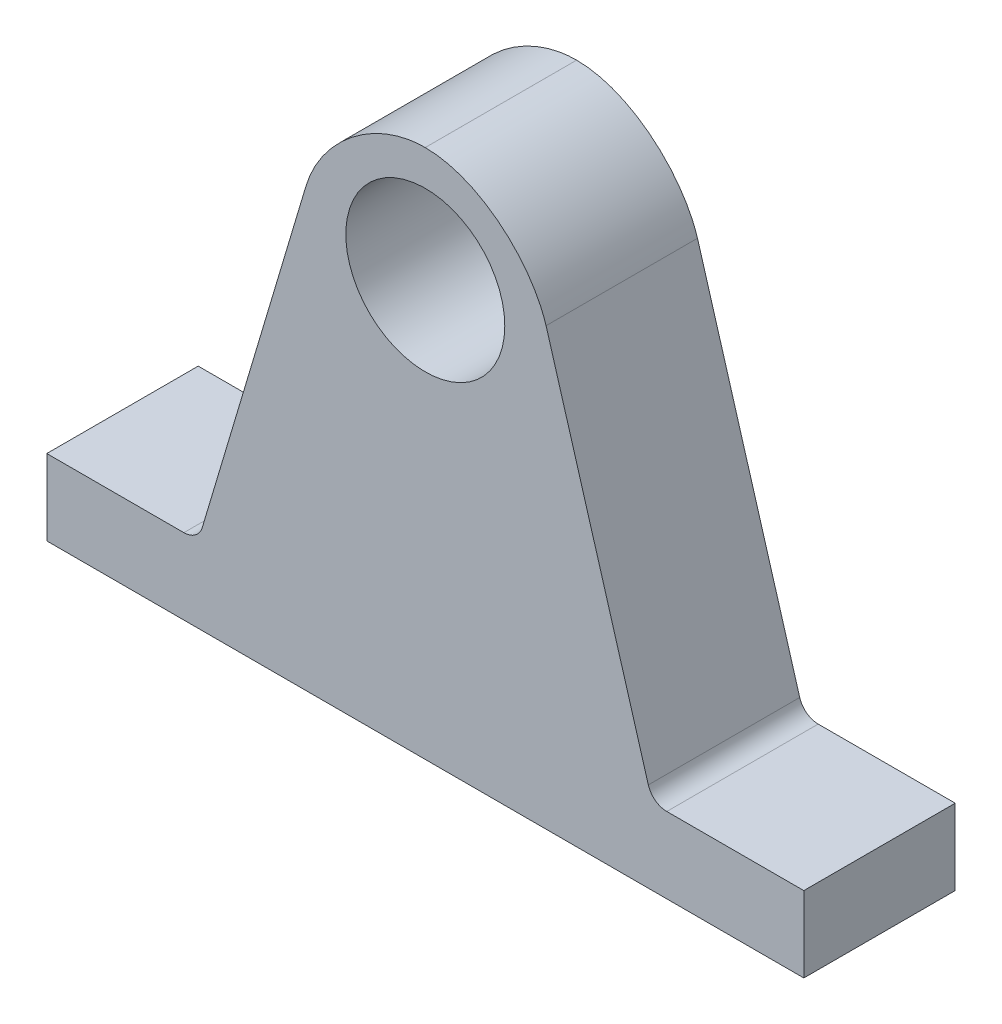
ISO-10303-21;
HEADER;
FILE_DESCRIPTION(('STEP AP214'),'2;1');
FILE_NAME('part.step','',(''),(''),'','','');
FILE_SCHEMA(('AUTOMOTIVE_DESIGN { 1 0 10303 214 1 1 1 1 }'));
ENDSEC;
DATA;
#1=APPLICATION_CONTEXT('core data for automotive mechanical design processes');
#2=APPLICATION_PROTOCOL_DEFINITION('international standard','automotive_design',2000,#1);
#3=PRODUCT_CONTEXT('',#1,'mechanical');
#4=PRODUCT('Part','Part','',(#3));
#5=PRODUCT_RELATED_PRODUCT_CATEGORY('part','',(#4));
#6=PRODUCT_DEFINITION_FORMATION('','',#4);
#7=PRODUCT_DEFINITION_CONTEXT('part definition',#1,'design');
#8=PRODUCT_DEFINITION('design','',#6,#7);
#9=PRODUCT_DEFINITION_SHAPE('','',#8);
#10=(LENGTH_UNIT() NAMED_UNIT(*) SI_UNIT(.MILLI.,.METRE.));
#11=(NAMED_UNIT(*) PLANE_ANGLE_UNIT() SI_UNIT($,.RADIAN.));
#12=(NAMED_UNIT(*) SI_UNIT($,.STERADIAN.) SOLID_ANGLE_UNIT());
#13=UNCERTAINTY_MEASURE_WITH_UNIT(LENGTH_MEASURE(1.E-05),#10,'distance_accuracy_value','');
#14=(GEOMETRIC_REPRESENTATION_CONTEXT(3) GLOBAL_UNCERTAINTY_ASSIGNED_CONTEXT((#13)) GLOBAL_UNIT_ASSIGNED_CONTEXT((#10,
#11,#12)) REPRESENTATION_CONTEXT('',''));
#15=CARTESIAN_POINT('',(0.,0.,0.));
#16=DIRECTION('',(0.,0.,1.));
#17=DIRECTION('',(1.,0.,0.));
#18=AXIS2_PLACEMENT_3D('',#15,#16,#17);
#19=CARTESIAN_POINT('',(32.7115208670572,12.54,-44.5746974611739));
#20=DIRECTION('',(0.,0.,1.));
#21=DIRECTION('',(1.,0.,0.));
#22=AXIS2_PLACEMENT_3D('',#19,#20,#21);
#23=CYLINDRICAL_SURFACE('',#22,2.54);
#24=DIRECTION('',(0.,0.,-1.));
#25=VECTOR('',#24,1.);
#26=CARTESIAN_POINT('',(30.2753489746446,11.8212048201201,-44.5746974611739));
#27=LINE('',#26,#25);
#28=CARTESIAN_POINT('',(30.2753489746446,11.8212048201201,15.4253025388261));
#29=VERTEX_POINT('',#28);
#30=CARTESIAN_POINT('',(30.2753489746446,11.8212048201201,-4.57469746117392));
#31=VERTEX_POINT('',#30);
#32=EDGE_CURVE('E284',#29,#31,#27,.T.);
#33=ORIENTED_EDGE('',*,*,#32,.F.);
#34=CARTESIAN_POINT('',(32.7115208670572,12.54,15.4253025388261));
#35=DIRECTION('',(0.,0.,-1.));
#36=DIRECTION('',(-1.,0.,0.));
#37=AXIS2_PLACEMENT_3D('',#34,#35,#36);
#38=CIRCLE('',#37,2.54);
#39=CARTESIAN_POINT('',(32.7115208670573,10.,15.4253025388261));
#40=VERTEX_POINT('',#39);
#41=EDGE_CURVE('E74',#29,#40,#38,.F.);
#42=ORIENTED_EDGE('',*,*,#41,.T.);
#43=DIRECTION('',(0.,0.,-1.));
#44=VECTOR('',#43,1.);
#45=CARTESIAN_POINT('',(32.7115208670572,10.,-44.5746974611739));
#46=LINE('',#45,#44);
#47=CARTESIAN_POINT('',(32.7115208670573,10.,-4.57469746117392));
#48=VERTEX_POINT('',#47);
#49=EDGE_CURVE('E286',#48,#40,#46,.F.);
#50=ORIENTED_EDGE('',*,*,#49,.F.);
#51=CARTESIAN_POINT('',(32.7115208670572,12.54,-4.57469746117392));
#52=DIRECTION('',(0.,0.,1.));
#53=DIRECTION('',(1.,0.,0.));
#54=AXIS2_PLACEMENT_3D('',#51,#52,#53);
#55=CIRCLE('',#54,2.54);
#56=EDGE_CURVE('E12',#48,#31,#55,.F.);
#57=ORIENTED_EDGE('',*,*,#56,.T.);
#58=EDGE_LOOP('',(#33,#42,#50,#57));
#59=FACE_BOUND('',#58,.T.);
#60=ADVANCED_FACE('F67',(#59),#23,.F.);
#61=CARTESIAN_POINT('',(-31.0801536854342,12.54,-44.5746974611739));
#62=DIRECTION('',(0.,0.,1.));
#63=DIRECTION('',(1.,0.,0.));
#64=AXIS2_PLACEMENT_3D('',#61,#62,#63);
#65=CYLINDRICAL_SURFACE('',#64,2.54);
#66=DIRECTION('',(0.,0.,1.));
#67=VECTOR('',#66,1.);
#68=CARTESIAN_POINT('',(-28.6461637260663,11.813850650557,-44.5746974611739));
#69=LINE('',#68,#67);
#70=CARTESIAN_POINT('',(-28.6461637260663,11.813850650557,-4.57469746117392));
#71=VERTEX_POINT('',#70);
#72=CARTESIAN_POINT('',(-28.6461637260663,11.813850650557,15.4253025388261));
#73=VERTEX_POINT('',#72);
#74=EDGE_CURVE('E240',#71,#73,#69,.T.);
#75=ORIENTED_EDGE('',*,*,#74,.F.);
#76=CARTESIAN_POINT('',(-31.0801536854342,12.54,-4.57469746117392));
#77=DIRECTION('',(0.,0.,1.));
#78=DIRECTION('',(1.,0.,0.));
#79=AXIS2_PLACEMENT_3D('',#76,#77,#78);
#80=CIRCLE('',#79,2.54);
#81=CARTESIAN_POINT('',(-31.0801536854342,10.,-4.57469746117392));
#82=VERTEX_POINT('',#81);
#83=EDGE_CURVE('E348',#71,#82,#80,.F.);
#84=ORIENTED_EDGE('',*,*,#83,.T.);
#85=DIRECTION('',(0.,0.,1.));
#86=VECTOR('',#85,1.);
#87=CARTESIAN_POINT('',(-31.0801536854342,10.,0.));
#88=LINE('',#87,#86);
#89=CARTESIAN_POINT('',(-31.0801536854342,10.,15.4253025388261));
#90=VERTEX_POINT('',#89);
#91=EDGE_CURVE('E243',#90,#82,#88,.F.);
#92=ORIENTED_EDGE('',*,*,#91,.F.);
#93=CARTESIAN_POINT('',(-31.0801536854342,12.54,15.4253025388261));
#94=DIRECTION('',(0.,0.,-1.));
#95=DIRECTION('',(-1.,0.,0.));
#96=AXIS2_PLACEMENT_3D('',#93,#94,#95);
#97=CIRCLE('',#96,2.54);
#98=EDGE_CURVE('E287',#90,#73,#97,.F.);
#99=ORIENTED_EDGE('',*,*,#98,.T.);
#100=EDGE_LOOP('',(#75,#84,#92,#99));
#101=FACE_BOUND('',#100,.T.);
#102=ADVANCED_FACE('F347',(#101),#65,.F.);
#103=CARTESIAN_POINT('',(-49.187302552387,10.,15.4253025388261));
#104=DIRECTION('',(0.,0.,-1.));
#105=DIRECTION('',(-1.,0.,0.));
#106=AXIS2_PLACEMENT_3D('',#103,#104,#105);
#107=PLANE('',#106);
#108=ORIENTED_EDGE('',*,*,#41,.F.);
#109=DIRECTION('',(-0.28299022829917,0.959122792288445,0.));
#110=VECTOR('',#109,1.);
#111=CARTESIAN_POINT('',(31.0593335166884,9.16409030561789,15.4253025388261));
#112=LINE('',#111,#110);
#113=CARTESIAN_POINT('',(16.7674884994213,57.6026331567285,15.4253025388261));
#114=VERTEX_POINT('',#113);
#115=EDGE_CURVE('E153',#29,#114,#112,.T.);
#116=ORIENTED_EDGE('',*,*,#115,.T.);
#117=CARTESIAN_POINT('',(-14.9856740840796,57.6026331567285,15.4253025388261));
#118=CARTESIAN_POINT('',(-13.1285771504225,64.0995192015089,15.4253025388261));
#119=CARTESIAN_POINT('',(0.864488627951838,75.934906687618,15.4253025388261));
#120=CARTESIAN_POINT('',(14.7692056651984,64.0304810450589,15.4253025388261));
#121=CARTESIAN_POINT('',(16.7674884994213,57.6026331567285,15.4253025388261));
#122=B_SPLINE_CURVE_WITH_KNOTS('',3,(#117,#118,#119,#120,#121),.UNSPECIFIED.,.F.,.F.,(4,1,4),
(0.,0.49893525965505,1.),.UNSPECIFIED.);
#123=CARTESIAN_POINT('',(0.805895989723645,70.,15.4253025388261));
#124=VERTEX_POINT('',#123);
#125=EDGE_CURVE('E159',#124,#114,#122,.T.);
#126=ORIENTED_EDGE('',*,*,#125,.F.);
#127=DIRECTION('',(1.,0.,0.));
#128=VECTOR('',#127,1.);
#129=CARTESIAN_POINT('',(0.,70.,15.4253025388261));
#130=LINE('',#129,#128);
#131=CARTESIAN_POINT('',(0.804550116485897,70.000002024231,15.4253025388261));
#132=VERTEX_POINT('',#131);
#133=EDGE_CURVE('E268',#132,#124,#130,.T.);
#134=ORIENTED_EDGE('',*,*,#133,.F.);
#135=CARTESIAN_POINT('',(-14.9856740840796,57.6026331567285,15.4253025388261));
#136=CARTESIAN_POINT('',(-13.1285771504225,64.0995192015089,15.4253025388261));
#137=CARTESIAN_POINT('',(0.864488627951838,75.934906687618,15.4253025388261));
#138=CARTESIAN_POINT('',(14.7692056651984,64.0304810450589,15.4253025388261));
#139=CARTESIAN_POINT('',(16.7674884994213,57.6026331567285,15.4253025388261));
#140=B_SPLINE_CURVE_WITH_KNOTS('',3,(#135,#136,#137,#138,#139),.UNSPECIFIED.,.F.,.F.,(4,1,4),
(0.,0.49893525965505,1.),.UNSPECIFIED.);
#141=CARTESIAN_POINT('',(-14.9856740840796,57.6026331567285,15.4253025388261));
#142=VERTEX_POINT('',#141);
#143=EDGE_CURVE('E209',#142,#132,#140,.T.);
#144=ORIENTED_EDGE('',*,*,#143,.F.);
#145=DIRECTION('',(0.285885570646856,0.958263763530648,0.));
#146=VECTOR('',#145,1.);
#147=CARTESIAN_POINT('',(-29.5413458130373,8.81327754095562,15.4253025388261));
#148=LINE('',#147,#146);
#149=EDGE_CURVE('E176',#73,#142,#148,.T.);
#150=ORIENTED_EDGE('',*,*,#149,.F.);
#151=ORIENTED_EDGE('',*,*,#98,.F.);
#152=DIRECTION('',(1.,0.,0.));
#153=VECTOR('',#152,1.);
#154=CARTESIAN_POINT('',(-49.187302552387,10.,15.4253025388261));
#155=LINE('',#154,#153);
#156=CARTESIAN_POINT('',(-49.187302552387,10.,15.4253025388261));
#157=VERTEX_POINT('',#156);
#158=EDGE_CURVE('E263',#157,#90,#155,.T.);
#159=ORIENTED_EDGE('',*,*,#158,.F.);
#160=DIRECTION('',(0.,-1.,0.));
#161=VECTOR('',#160,1.);
#162=CARTESIAN_POINT('',(-49.187302552387,10.,15.4253025388261));
#163=LINE('',#162,#161);
#164=CARTESIAN_POINT('',(-49.187302552387,0.,15.4253025388261));
#165=VERTEX_POINT('',#164);
#166=EDGE_CURVE('E271',#157,#165,#163,.T.);
#167=ORIENTED_EDGE('',*,*,#166,.T.);
#168=DIRECTION('',(1.,0.,0.));
#169=VECTOR('',#168,1.);
#170=CARTESIAN_POINT('',(-49.187302552387,0.,15.4253025388261));
#171=LINE('',#170,#169);
#172=CARTESIAN_POINT('',(50.812697447613,0.,15.4253025388261));
#173=VERTEX_POINT('',#172);
#174=EDGE_CURVE('E300',#165,#173,#171,.T.);
#175=ORIENTED_EDGE('',*,*,#174,.T.);
#176=DIRECTION('',(0.,-1.,0.));
#177=VECTOR('',#176,1.);
#178=CARTESIAN_POINT('',(50.812697447613,10.,15.4253025388261));
#179=LINE('',#178,#177);
#180=CARTESIAN_POINT('',(50.812697447613,10.,15.4253025388261));
#181=VERTEX_POINT('',#180);
#182=EDGE_CURVE('E316',#181,#173,#179,.T.);
#183=ORIENTED_EDGE('',*,*,#182,.F.);
#184=EDGE_CURVE('E288',#40,#181,#155,.T.);
#185=ORIENTED_EDGE('',*,*,#184,.F.);
#186=EDGE_LOOP('',(#108,#116,#126,#134,#144,#150,#151,#159,#167,#175,#183,#185));
#187=FACE_BOUND('',#186,.T.);
#188=CARTESIAN_POINT('',(0.812697447612962,54.837920596,15.4253025388261));
#189=DIRECTION('',(0.,0.,1.));
#190=DIRECTION('',(1.,0.,0.));
#191=AXIS2_PLACEMENT_3D('',#188,#189,#190);
#192=CIRCLE('',#191,10.5);
#193=CARTESIAN_POINT('',(11.312697447613,54.837920596,15.4253025388261));
#194=VERTEX_POINT('',#193);
#195=EDGE_CURVE('E233',#194,#194,#192,.T.);
#196=ORIENTED_EDGE('',*,*,#195,.F.);
#197=EDGE_LOOP('',(#196));
#198=FACE_BOUND('',#197,.T.);
#199=ADVANCED_FACE('F155',(#187,#198),#107,.F.);
#200=CARTESIAN_POINT('',(-49.187302552387,10.,-4.57469746117392));
#201=DIRECTION('',(0.,0.,1.));
#202=DIRECTION('',(1.,0.,0.));
#203=AXIS2_PLACEMENT_3D('',#200,#201,#202);
#204=PLANE('',#203);
#205=ORIENTED_EDGE('',*,*,#83,.F.);
#206=DIRECTION('',(0.285885570646856,0.958263763530648,0.));
#207=VECTOR('',#206,1.);
#208=CARTESIAN_POINT('',(-30.8219137424686,4.52092434265674,-4.57469746117392));
#209=LINE('',#208,#207);
#210=CARTESIAN_POINT('',(-14.9856740840796,57.6026331567285,-4.57469746117392));
#211=VERTEX_POINT('',#210);
#212=EDGE_CURVE('E227',#71,#211,#209,.T.);
#213=ORIENTED_EDGE('',*,*,#212,.T.);
#214=CARTESIAN_POINT('',(-14.9856740840796,57.6026331567285,-4.57469746117392));
#215=CARTESIAN_POINT('',(-13.1285771504225,64.0995192015089,-4.57469746117392));
#216=CARTESIAN_POINT('',(0.864488627951838,75.934906687618,-4.57469746117392));
#217=CARTESIAN_POINT('',(14.7692056651984,64.0304810450589,-4.57469746117392));
#218=CARTESIAN_POINT('',(16.7674884994213,57.6026331567285,-4.57469746117392));
#219=B_SPLINE_CURVE_WITH_KNOTS('',3,(#214,#215,#216,#217,#218),.UNSPECIFIED.,.F.,.F.,(4,1,4),
(0.,0.49893525965505,1.),.UNSPECIFIED.);
#220=CARTESIAN_POINT('',(0.804550116485899,70.0000026989747,-4.57469746117393));
#221=VERTEX_POINT('',#220);
#222=EDGE_CURVE('E222',#211,#221,#219,.T.);
#223=ORIENTED_EDGE('',*,*,#222,.T.);
#224=DIRECTION('',(-1.,0.,0.));
#225=VECTOR('',#224,1.);
#226=CARTESIAN_POINT('',(-29.187302552387,70.,-4.57469746117392));
#227=LINE('',#226,#225);
#228=CARTESIAN_POINT('',(0.805895989723645,70.,-4.57469746117392));
#229=VERTEX_POINT('',#228);
#230=EDGE_CURVE('E275',#229,#221,#227,.T.);
#231=ORIENTED_EDGE('',*,*,#230,.F.);
#232=CARTESIAN_POINT('',(-14.9856740840796,57.6026331567285,-4.57469746117392));
#233=CARTESIAN_POINT('',(-13.1285771504225,64.0995192015089,-4.57469746117392));
#234=CARTESIAN_POINT('',(0.864488627951838,75.934906687618,-4.57469746117392));
#235=CARTESIAN_POINT('',(14.7692056651984,64.0304810450589,-4.57469746117392));
#236=CARTESIAN_POINT('',(16.7674884994213,57.6026331567285,-4.57469746117392));
#237=B_SPLINE_CURVE_WITH_KNOTS('',3,(#232,#233,#234,#235,#236),.UNSPECIFIED.,.F.,.F.,(4,1,4),
(0.,0.49893525965505,1.),.UNSPECIFIED.);
#238=CARTESIAN_POINT('',(16.7674884994213,57.6026331567285,-4.57469746117392));
#239=VERTEX_POINT('',#238);
#240=EDGE_CURVE('E244',#229,#239,#237,.T.);
#241=ORIENTED_EDGE('',*,*,#240,.T.);
#242=DIRECTION('',(-0.28299022829917,0.959122792288445,0.));
#243=VECTOR('',#242,1.);
#244=CARTESIAN_POINT('',(24.4060199025876,31.7137902365315,-4.57469746117392));
#245=LINE('',#244,#243);
#246=EDGE_CURVE('E169',#31,#239,#245,.T.);
#247=ORIENTED_EDGE('',*,*,#246,.F.);
#248=ORIENTED_EDGE('',*,*,#56,.F.);
#249=DIRECTION('',(-1.,0.,0.));
#250=VECTOR('',#249,1.);
#251=CARTESIAN_POINT('',(-49.187302552387,10.,-4.57469746117392));
#252=LINE('',#251,#250);
#253=CARTESIAN_POINT('',(50.812697447613,10.,-4.57469746117392));
#254=VERTEX_POINT('',#253);
#255=EDGE_CURVE('E248',#254,#48,#252,.T.);
#256=ORIENTED_EDGE('',*,*,#255,.F.);
#257=DIRECTION('',(0.,-1.,0.));
#258=VECTOR('',#257,1.);
#259=CARTESIAN_POINT('',(50.812697447613,10.,-4.57469746117392));
#260=LINE('',#259,#258);
#261=CARTESIAN_POINT('',(50.812697447613,0.,-4.57469746117392));
#262=VERTEX_POINT('',#261);
#263=EDGE_CURVE('E313',#254,#262,#260,.T.);
#264=ORIENTED_EDGE('',*,*,#263,.T.);
#265=DIRECTION('',(-1.,0.,0.));
#266=VECTOR('',#265,1.);
#267=CARTESIAN_POINT('',(-49.187302552387,0.,-4.57469746117392));
#268=LINE('',#267,#266);
#269=CARTESIAN_POINT('',(-49.187302552387,0.,-4.57469746117392));
#270=VERTEX_POINT('',#269);
#271=EDGE_CURVE('E295',#262,#270,#268,.T.);
#272=ORIENTED_EDGE('',*,*,#271,.T.);
#273=DIRECTION('',(0.,-1.,0.));
#274=VECTOR('',#273,1.);
#275=CARTESIAN_POINT('',(-49.187302552387,10.,-4.57469746117392));
#276=LINE('',#275,#274);
#277=CARTESIAN_POINT('',(-49.187302552387,10.,-4.57469746117392));
#278=VERTEX_POINT('',#277);
#279=EDGE_CURVE('E262',#278,#270,#276,.T.);
#280=ORIENTED_EDGE('',*,*,#279,.F.);
#281=EDGE_CURVE('E245',#82,#278,#252,.T.);
#282=ORIENTED_EDGE('',*,*,#281,.F.);
#283=EDGE_LOOP('',(#205,#213,#223,#231,#241,#247,#248,#256,#264,#272,#280,#282));
#284=FACE_BOUND('',#283,.T.);
#285=CARTESIAN_POINT('',(0.812697447612962,54.837920596,-4.57469746117392));
#286=DIRECTION('',(0.,0.,1.));
#287=DIRECTION('',(1.,0.,0.));
#288=AXIS2_PLACEMENT_3D('',#285,#286,#287);
#289=CIRCLE('',#288,10.5);
#290=CARTESIAN_POINT('',(11.312697447613,54.837920596,-4.57469746117392));
#291=VERTEX_POINT('',#290);
#292=EDGE_CURVE('E265',#291,#291,#289,.T.);
#293=ORIENTED_EDGE('',*,*,#292,.T.);
#294=EDGE_LOOP('',(#293));
#295=FACE_BOUND('',#294,.T.);
#296=ADVANCED_FACE('F326',(#284,#295),#204,.F.);
#297=CARTESIAN_POINT('',(0.,70.,0.));
#298=DIRECTION('',(0.,1.,0.));
#299=DIRECTION('',(0.,0.,1.));
#300=AXIS2_PLACEMENT_3D('',#297,#298,#299);
#301=PLANE('',#300);
#302=DIRECTION('',(0.,0.,1.));
#303=VECTOR('',#302,1.);
#304=CARTESIAN_POINT('',(0.805895989723645,70.,-44.5746974611739));
#305=LINE('',#304,#303);
#306=EDGE_CURVE('E165',#229,#124,#305,.T.);
#307=ORIENTED_EDGE('',*,*,#306,.F.);
#308=ORIENTED_EDGE('',*,*,#230,.T.);
#309=DIRECTION('',(0.,0.,1.));
#310=VECTOR('',#309,1.);
#311=CARTESIAN_POINT('',(0.804550116485899,70.0000026989747,-44.5746974611739));
#312=LINE('',#311,#310);
#313=EDGE_CURVE('E269',#221,#132,#312,.T.);
#314=ORIENTED_EDGE('',*,*,#313,.T.);
#315=ORIENTED_EDGE('',*,*,#133,.T.);
#316=EDGE_LOOP('',(#307,#308,#314,#315));
#317=FACE_BOUND('',#316,.T.);
#318=ADVANCED_FACE('F338',(#317),#301,.T.);
#319=CARTESIAN_POINT('',(0.,10.,0.));
#320=DIRECTION('',(0.,1.,0.));
#321=DIRECTION('',(0.,0.,1.));
#322=AXIS2_PLACEMENT_3D('',#319,#320,#321);
#323=PLANE('',#322);
#324=ORIENTED_EDGE('',*,*,#158,.T.);
#325=ORIENTED_EDGE('',*,*,#91,.T.);
#326=ORIENTED_EDGE('',*,*,#281,.T.);
#327=DIRECTION('',(0.,0.,1.));
#328=VECTOR('',#327,1.);
#329=CARTESIAN_POINT('',(-49.187302552387,10.,-4.57469746117392));
#330=LINE('',#329,#328);
#331=EDGE_CURVE('E290',#278,#157,#330,.T.);
#332=ORIENTED_EDGE('',*,*,#331,.T.);
#333=EDGE_LOOP('',(#324,#325,#326,#332));
#334=FACE_BOUND('',#333,.T.);
#335=ADVANCED_FACE('F322',(#334),#323,.T.);
#336=CARTESIAN_POINT('',(-49.187302552387,10.,-4.57469746117392));
#337=DIRECTION('',(1.,0.,0.));
#338=DIRECTION('',(0.,0.,-1.));
#339=AXIS2_PLACEMENT_3D('',#336,#337,#338);
#340=PLANE('',#339);
#341=DIRECTION('',(0.,0.,1.));
#342=VECTOR('',#341,1.);
#343=CARTESIAN_POINT('',(-49.187302552387,0.,-4.57469746117392));
#344=LINE('',#343,#342);
#345=EDGE_CURVE('E255',#270,#165,#344,.T.);
#346=ORIENTED_EDGE('',*,*,#345,.T.);
#347=ORIENTED_EDGE('',*,*,#166,.F.);
#348=ORIENTED_EDGE('',*,*,#331,.F.);
#349=ORIENTED_EDGE('',*,*,#279,.T.);
#350=EDGE_LOOP('',(#346,#347,#348,#349));
#351=FACE_BOUND('',#350,.T.);
#352=ADVANCED_FACE('F319',(#351),#340,.F.);
#353=CARTESIAN_POINT('',(50.812697447613,10.,-4.57469746117392));
#354=DIRECTION('',(-1.,0.,0.));
#355=DIRECTION('',(0.,0.,1.));
#356=AXIS2_PLACEMENT_3D('',#353,#354,#355);
#357=PLANE('',#356);
#358=DIRECTION('',(0.,0.,-1.));
#359=VECTOR('',#358,1.);
#360=CARTESIAN_POINT('',(50.812697447613,0.,-4.57469746117392));
#361=LINE('',#360,#359);
#362=EDGE_CURVE('E305',#173,#262,#361,.T.);
#363=ORIENTED_EDGE('',*,*,#362,.T.);
#364=ORIENTED_EDGE('',*,*,#263,.F.);
#365=DIRECTION('',(0.,0.,-1.));
#366=VECTOR('',#365,1.);
#367=CARTESIAN_POINT('',(50.812697447613,10.,-4.57469746117392));
#368=LINE('',#367,#366);
#369=EDGE_CURVE('E249',#181,#254,#368,.T.);
#370=ORIENTED_EDGE('',*,*,#369,.F.);
#371=ORIENTED_EDGE('',*,*,#182,.T.);
#372=EDGE_LOOP('',(#363,#364,#370,#371));
#373=FACE_BOUND('',#372,.T.);
#374=ADVANCED_FACE('F334',(#373),#357,.F.);
#375=ORIENTED_EDGE('',*,*,#255,.T.);
#376=ORIENTED_EDGE('',*,*,#49,.T.);
#377=ORIENTED_EDGE('',*,*,#184,.T.);
#378=ORIENTED_EDGE('',*,*,#369,.T.);
#379=EDGE_LOOP('',(#375,#376,#377,#378));
#380=FACE_BOUND('',#379,.T.);
#381=ADVANCED_FACE('F337',(#380),#323,.T.);
#382=CARTESIAN_POINT('',(0.,0.,0.));
#383=DIRECTION('',(0.,1.,0.));
#384=DIRECTION('',(0.,0.,1.));
#385=AXIS2_PLACEMENT_3D('',#382,#383,#384);
#386=PLANE('',#385);
#387=ORIENTED_EDGE('',*,*,#345,.F.);
#388=ORIENTED_EDGE('',*,*,#271,.F.);
#389=ORIENTED_EDGE('',*,*,#362,.F.);
#390=ORIENTED_EDGE('',*,*,#174,.F.);
#391=EDGE_LOOP('',(#387,#388,#389,#390));
#392=FACE_BOUND('',#391,.T.);
#393=ADVANCED_FACE('F332',(#392),#386,.F.);
#394=CARTESIAN_POINT('',(0.812697447612962,54.837920596,-44.5746974611739));
#395=DIRECTION('',(0.,0.,1.));
#396=DIRECTION('',(1.,0.,0.));
#397=AXIS2_PLACEMENT_3D('',#394,#395,#396);
#398=CYLINDRICAL_SURFACE('',#397,10.5);
#399=ORIENTED_EDGE('',*,*,#195,.T.);
#400=EDGE_LOOP('',(#399));
#401=FACE_BOUND('',#400,.T.);
#402=ORIENTED_EDGE('',*,*,#292,.F.);
#403=EDGE_LOOP('',(#402));
#404=FACE_BOUND('',#403,.T.);
#405=ADVANCED_FACE('F364',(#401,#404),#398,.F.);
#406=CARTESIAN_POINT('',(-29.5413458130373,8.81327754095562,-44.5746974611739));
#407=DIRECTION('',(0.958263763530648,-0.285885570646856,0.));
#408=DIRECTION('',(0.285885570646856,0.958263763530648,0.));
#409=AXIS2_PLACEMENT_3D('',#406,#407,#408);
#410=PLANE('',#409);
#411=ORIENTED_EDGE('',*,*,#212,.F.);
#412=ORIENTED_EDGE('',*,*,#74,.T.);
#413=ORIENTED_EDGE('',*,*,#149,.T.);
#414=DIRECTION('',(0.,0.,1.));
#415=VECTOR('',#414,1.);
#416=CARTESIAN_POINT('',(-14.9856740840796,57.6026331567285,-44.5746974611739));
#417=LINE('',#416,#415);
#418=EDGE_CURVE('E216',#211,#142,#417,.T.);
#419=ORIENTED_EDGE('',*,*,#418,.F.);
#420=EDGE_LOOP('',(#411,#412,#413,#419));
#421=FACE_BOUND('',#420,.T.);
#422=ADVANCED_FACE('F202',(#421),#410,.F.);
#423=CARTESIAN_POINT('',(-14.9856740840796,57.6026331567285,-44.5746974611739));
#424=CARTESIAN_POINT('',(-13.1285771504225,64.0995192015089,-44.5746974611739));
#425=CARTESIAN_POINT('',(0.864488627951838,75.934906687618,-44.5746974611739));
#426=CARTESIAN_POINT('',(14.7692056651984,64.0304810450589,-44.5746974611739));
#427=CARTESIAN_POINT('',(16.7674884994213,57.6026331567285,-44.5746974611739));
#428=B_SPLINE_CURVE_WITH_KNOTS('',3,(#423,#424,#425,#426,#427),.UNSPECIFIED.,.F.,.F.,(4,1,4),
(0.,0.49893525965505,1.),.UNSPECIFIED.);
#429=DIRECTION('',(0.,0.,1.));
#430=VECTOR('',#429,1.);
#431=SURFACE_OF_LINEAR_EXTRUSION('',#428,#430);
#432=ORIENTED_EDGE('',*,*,#418,.T.);
#433=ORIENTED_EDGE('',*,*,#143,.T.);
#434=ORIENTED_EDGE('',*,*,#313,.F.);
#435=ORIENTED_EDGE('',*,*,#222,.F.);
#436=EDGE_LOOP('',(#432,#433,#434,#435));
#437=FACE_BOUND('',#436,.T.);
#438=ADVANCED_FACE('F197',(#437),#431,.F.);
#439=CARTESIAN_POINT('',(-14.9856740840796,57.6026331567285,-44.5746974611739));
#440=CARTESIAN_POINT('',(-13.1285771504225,64.0995192015089,-44.5746974611739));
#441=CARTESIAN_POINT('',(0.864488627951838,75.934906687618,-44.5746974611739));
#442=CARTESIAN_POINT('',(14.7692056651984,64.0304810450589,-44.5746974611739));
#443=CARTESIAN_POINT('',(16.7674884994213,57.6026331567285,-44.5746974611739));
#444=B_SPLINE_CURVE_WITH_KNOTS('',3,(#439,#440,#441,#442,#443),.UNSPECIFIED.,.F.,.F.,(4,1,4),
(0.,0.49893525965505,1.),.UNSPECIFIED.);
#445=DIRECTION('',(0.,0.,1.));
#446=VECTOR('',#445,1.);
#447=SURFACE_OF_LINEAR_EXTRUSION('',#444,#446);
#448=ORIENTED_EDGE('',*,*,#306,.T.);
#449=ORIENTED_EDGE('',*,*,#125,.T.);
#450=DIRECTION('',(0.,0.,1.));
#451=VECTOR('',#450,1.);
#452=CARTESIAN_POINT('',(16.7674884994213,57.6026331567285,-44.5746974611739));
#453=LINE('',#452,#451);
#454=EDGE_CURVE('E164',#239,#114,#453,.T.);
#455=ORIENTED_EDGE('',*,*,#454,.F.);
#456=ORIENTED_EDGE('',*,*,#240,.F.);
#457=EDGE_LOOP('',(#448,#449,#455,#456));
#458=FACE_BOUND('',#457,.T.);
#459=ADVANCED_FACE('F173',(#458),#447,.F.);
#460=CARTESIAN_POINT('',(31.0593335166884,9.16409030561789,-44.5746974611739));
#461=DIRECTION('',(0.959122792288445,0.28299022829917,0.));
#462=DIRECTION('',(-0.28299022829917,0.959122792288445,0.));
#463=AXIS2_PLACEMENT_3D('',#460,#461,#462);
#464=PLANE('',#463);
#465=ORIENTED_EDGE('',*,*,#115,.F.);
#466=ORIENTED_EDGE('',*,*,#32,.T.);
#467=ORIENTED_EDGE('',*,*,#246,.T.);
#468=ORIENTED_EDGE('',*,*,#454,.T.);
#469=EDGE_LOOP('',(#465,#466,#467,#468));
#470=FACE_BOUND('',#469,.T.);
#471=ADVANCED_FACE('F168',(#470),#464,.T.);
#472=CLOSED_SHELL('',(#60,#102,#199,#296,#318,#335,#352,#374,#381,#393,#405,#422,#438,#459,#471));
#473=MANIFOLD_SOLID_BREP('B2',#472);
#474=ADVANCED_BREP_SHAPE_REPRESENTATION('',(#18,#473),#14);
#475=SHAPE_DEFINITION_REPRESENTATION(#9,#474);
ENDSEC;
END-ISO-10303-21;
